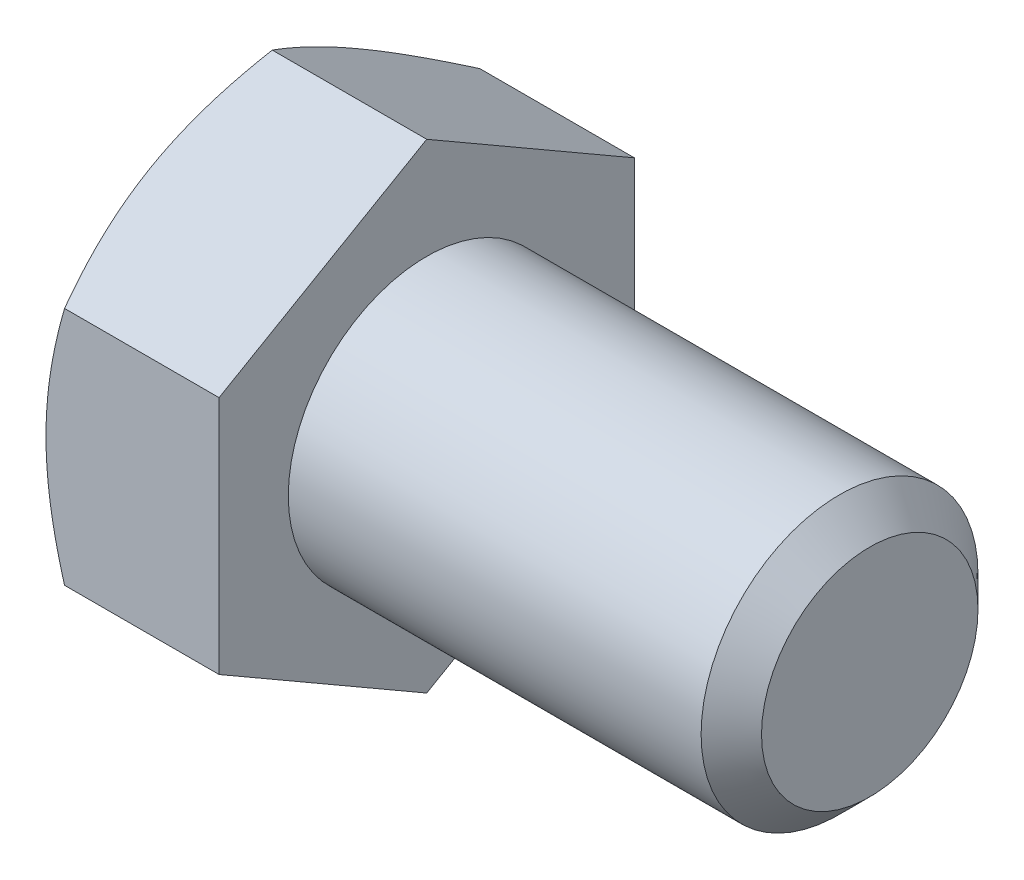
ISO-10303-21;
HEADER;
FILE_DESCRIPTION(('STEP AP214'),'2;1');
FILE_NAME('part.step','',(''),(''),'','','');
FILE_SCHEMA(('AUTOMOTIVE_DESIGN { 1 0 10303 214 1 1 1 1 }'));
ENDSEC;
DATA;
#1=APPLICATION_CONTEXT('core data for automotive mechanical design processes');
#2=APPLICATION_PROTOCOL_DEFINITION('international standard','automotive_design',2000,#1);
#3=PRODUCT_CONTEXT('',#1,'mechanical');
#4=PRODUCT('Part','Part','',(#3));
#5=PRODUCT_RELATED_PRODUCT_CATEGORY('part','',(#4));
#6=PRODUCT_DEFINITION_FORMATION('','',#4);
#7=PRODUCT_DEFINITION_CONTEXT('part definition',#1,'design');
#8=PRODUCT_DEFINITION('design','',#6,#7);
#9=PRODUCT_DEFINITION_SHAPE('','',#8);
#10=(LENGTH_UNIT() NAMED_UNIT(*) SI_UNIT(.MILLI.,.METRE.));
#11=(NAMED_UNIT(*) PLANE_ANGLE_UNIT() SI_UNIT($,.RADIAN.));
#12=(NAMED_UNIT(*) SI_UNIT($,.STERADIAN.) SOLID_ANGLE_UNIT());
#13=UNCERTAINTY_MEASURE_WITH_UNIT(LENGTH_MEASURE(1.E-05),#10,'distance_accuracy_value','');
#14=(GEOMETRIC_REPRESENTATION_CONTEXT(3) GLOBAL_UNCERTAINTY_ASSIGNED_CONTEXT((#13)) GLOBAL_UNIT_ASSIGNED_CONTEXT((#10,
#11,#12)) REPRESENTATION_CONTEXT('',''));
#15=CARTESIAN_POINT('',(0.,0.,0.));
#16=DIRECTION('',(0.,0.,1.));
#17=DIRECTION('',(1.,0.,0.));
#18=AXIS2_PLACEMENT_3D('',#15,#16,#17);
#19=CARTESIAN_POINT('',(-17.6609375,-6.87407664253899,11.90625));
#20=DIRECTION('',(0.,0.,-1.));
#21=DIRECTION('',(-1.,0.,0.));
#22=AXIS2_PLACEMENT_3D('',#19,#20,#21);
#23=PLANE('',#22);
#24=CARTESIAN_POINT('',(-11.6983109266214,-18.7772218205503,11.90625));
#25=CARTESIAN_POINT('',(-11.8257583832551,-18.5158354897771,11.90625));
#26=CARTESIAN_POINT('',(-11.9525934779157,-18.2541507199369,11.90625));
#27=CARTESIAN_POINT('',(-12.2049008250829,-17.7301221221741,11.90625));
#28=CARTESIAN_POINT('',(-12.3303730647936,-17.467778288092,11.90625));
#29=CARTESIAN_POINT('',(-12.7045694499173,-16.6795991897897,11.90625));
#30=CARTESIAN_POINT('',(-12.9510377236248,-16.1526890226135,11.90625));
#31=CARTESIAN_POINT('',(-13.4377865658701,-15.0927248953816,11.90625));
#32=CARTESIAN_POINT('',(-13.6780287586066,-14.5596532720591,11.90625));
#33=CARTESIAN_POINT('',(-14.1490923927283,-13.4893779810417,11.90625));
#34=CARTESIAN_POINT('',(-14.3799142595246,-12.9521745012417,11.90625));
#35=CARTESIAN_POINT('',(-14.8373074478187,-11.8544133465978,11.90625));
#36=CARTESIAN_POINT('',(-15.0634666996025,-11.2936831131682,11.90625));
#37=CARTESIAN_POINT('',(-15.4994141642614,-10.1657754256603,11.90625));
#38=CARTESIAN_POINT('',(-15.7092005847877,-9.59859727348685,11.90625));
#39=CARTESIAN_POINT('',(-16.1071202172178,-8.4578727593714,11.90625));
#40=CARTESIAN_POINT('',(-16.2952946616349,-7.88434089249067,11.90625));
#41=CARTESIAN_POINT('',(-16.6441726177729,-6.72900365882738,11.90625));
#42=CARTESIAN_POINT('',(-16.8048844557365,-6.14720085781889,11.90625));
#43=CARTESIAN_POINT('',(-17.0192630164799,-5.26975884963066,11.90625));
#44=CARTESIAN_POINT('',(-17.0861220054402,-4.97732530698046,11.90625));
#45=CARTESIAN_POINT('',(-17.2101737537244,-4.39040451361311,11.90625));
#46=CARTESIAN_POINT('',(-17.267366696036,-4.09591730188382,11.90625));
#47=CARTESIAN_POINT('',(-17.3710969326411,-3.50507073805768,11.90625));
#48=CARTESIAN_POINT('',(-17.4176345106605,-3.20871143602591,11.90625));
#49=CARTESIAN_POINT('',(-17.4991389343129,-2.6144072694984,11.90625));
#50=CARTESIAN_POINT('',(-17.5341062538852,-2.31646247045567,11.90625));
#51=CARTESIAN_POINT('',(-17.5913188666794,-1.72343014702121,11.90625));
#52=CARTESIAN_POINT('',(-17.613730479768,-1.42835876821268,11.90625));
#53=CARTESIAN_POINT('',(-17.6460429444085,-0.837532164616394,11.90625));
#54=CARTESIAN_POINT('',(-17.6559440126664,-0.541776951762824,11.90625));
#55=CARTESIAN_POINT('',(-17.66299814625,0.0498900771026859,11.90625));
#56=CARTESIAN_POINT('',(-17.6601511405493,0.345801893977965,11.90625));
#57=CARTESIAN_POINT('',(-17.6417819063079,0.937234824328524,11.90625));
#58=CARTESIAN_POINT('',(-17.62625911627,1.23275591991524,11.90625));
#59=CARTESIAN_POINT('',(-17.5747499938461,1.93361141110705,11.90625));
#60=CARTESIAN_POINT('',(-17.5332714162141,2.33855153268826,11.90625));
#61=CARTESIAN_POINT('',(-17.428707328606,3.14561014398731,11.90625));
#62=CARTESIAN_POINT('',(-17.3656191456599,3.54772827836109,11.90625));
#63=CARTESIAN_POINT('',(-17.1472706380464,4.74927526762175,11.90625));
#64=CARTESIAN_POINT('',(-16.9629591081591,5.54350507595654,11.90625));
#65=CARTESIAN_POINT('',(-16.6409428101219,6.73176932461939,11.90625));
#66=CARTESIAN_POINT('',(-16.5244083585998,7.13189689477012,11.90625));
#67=CARTESIAN_POINT('',(-16.2786408125562,7.92827150501895,11.90625));
#68=CARTESIAN_POINT('',(-16.1494076191541,8.32451851487406,11.90625));
#69=CARTESIAN_POINT('',(-15.8803651397193,9.11324994675125,11.90625));
#70=CARTESIAN_POINT('',(-15.7405587808335,9.50573537649753,11.90625));
#71=CARTESIAN_POINT('',(-15.452074221942,10.2874106596633,11.90625));
#72=CARTESIAN_POINT('',(-15.3033962317092,10.6766005907578,11.90625));
#73=CARTESIAN_POINT('',(-14.8889342485984,11.7312027633438,11.90625));
#74=CARTESIAN_POINT('',(-14.615900351469,12.3937631906751,11.90625));
#75=CARTESIAN_POINT('',(-14.0535954119244,13.7119837854872,11.90625));
#76=CARTESIAN_POINT('',(-13.7643225072077,14.3676431512684,11.90625));
#77=CARTESIAN_POINT('',(-13.1734132974516,15.6736609985504,11.90625));
#78=CARTESIAN_POINT('',(-12.8717721370412,16.3240172757676,11.90625));
#79=CARTESIAN_POINT('',(-12.2591092932324,17.620247338022,11.90625));
#80=CARTESIAN_POINT('',(-11.948088006186,18.2661213110418,11.90625));
#81=CARTESIAN_POINT('',(-11.3182048158751,19.5553426390711,11.90625));
#82=CARTESIAN_POINT('',(-10.9993308622046,20.1986840939835,11.90625));
#83=CARTESIAN_POINT('',(-10.3557656991429,21.4824527079599,11.90625));
#84=CARTESIAN_POINT('',(-10.0310744394496,22.1228798417637,11.90625));
#85=CARTESIAN_POINT('',(-9.37709843477089,23.4011999735386,11.90625));
#86=CARTESIAN_POINT('',(-9.04781473862017,24.0390935087297,11.90625));
#87=CARTESIAN_POINT('',(-8.38544954318028,25.3129009144794,11.90625));
#88=CARTESIAN_POINT('',(-8.05236805659013,25.9488147916486,11.90625));
#89=CARTESIAN_POINT('',(-7.12015249604064,27.7180307819919,11.90625));
#90=CARTESIAN_POINT('',(-6.51761405583556,28.8495387236042,11.90625));
#91=CARTESIAN_POINT('',(-5.30533612668338,31.1087745049665,11.90625));
#92=CARTESIAN_POINT('',(-4.69559618068544,32.236502098898,11.90625));
#93=CARTESIAN_POINT('',(-3.47284694487996,34.4851874135602,11.90625));
#94=CARTESIAN_POINT('',(-2.85985596551435,35.6061550972182,11.90625));
#95=CARTESIAN_POINT('',(-1.93733123744413,37.2858774098767,11.90625));
#96=CARTESIAN_POINT('',(-1.62932900566449,37.8454742841365,11.90625));
#97=CARTESIAN_POINT('',(-1.01241722629891,38.9641668226993,11.90625));
#98=CARTESIAN_POINT('',(-0.703507679836878,39.5232624876221,11.90625));
#99=CARTESIAN_POINT('',(-0.394200833252019,40.0821383241844,11.90625));
#100=B_SPLINE_CURVE_WITH_KNOTS('',3,(#24,#25,#26,#27,#28,#29,#30,#31,#32,#33,#34,#35,#36,#37,
#38,#39,#40,#41,#42,#43,#44,#45,#46,#47,#48,#49,#50,#51,#52,#53,#54,#55,#56,#57,#58,#59,#60,#61,
#62,#63,#64,#65,#66,#67,#68,#69,#70,#71,#72,#73,#74,#75,#76,#77,#78,#79,#80,#81,#82,#83,#84,#85,
#86,#87,#88,#89,#90,#91,#92,#93,#94,#95,#96,#97,#98,#99),.UNSPECIFIED.,.F.,.F.,(4,2,2,2,2,2,2,2,
2,2,2,2,2,2,2,2,2,2,2,2,2,2,2,2,2,2,2,2,2,2,2,2,2,2,2,2,2,4),(0.,0.872403820379927,
1.74481582466604,3.48988256497024,5.24393083208546,6.99789980054986,8.81156709625109,
10.6254326580858,12.4357780289765,14.2455735532143,15.1453771860194,16.0451637827662,
16.9449264176478,17.8446521920104,18.7321594384487,19.619651311404,20.507148129058,
21.3946842621433,22.6151782011098,23.8358231619315,26.2782867397697,27.5284299401181,
28.7785828756662,30.0283909685039,31.2781695208875,33.4276822788816,35.5774420502025,
37.7280539815674,39.8785751669937,42.0326321377131,44.1867077434857,46.3402991990204,
48.4938834554972,52.3396542760515,56.1856704980939,60.0185346247368,61.9348133105576,
63.8510896236465),.UNSPECIFIED.);
#101=CARTESIAN_POINT('',(-16.597514142539,-6.87407664253899,11.90625));
#102=VERTEX_POINT('',#101);
#103=CARTESIAN_POINT('',(-17.6609375,0.,11.90625));
#104=VERTEX_POINT('',#103);
#105=EDGE_CURVE('E252',#102,#104,#100,.T.);
#106=ORIENTED_EDGE('',*,*,#105,.F.);
#107=DIRECTION('',(1.,0.,0.));
#108=VECTOR('',#107,1.);
#109=CARTESIAN_POINT('',(-17.6609375,-6.87407664253899,11.90625));
#110=LINE('',#109,#108);
#111=CARTESIAN_POINT('',(-7.7390625,-6.87407664253899,11.90625));
#112=VERTEX_POINT('',#111);
#113=EDGE_CURVE('E255',#102,#112,#110,.T.);
#114=ORIENTED_EDGE('',*,*,#113,.T.);
#115=DIRECTION('',(0.,1.,0.));
#116=VECTOR('',#115,1.);
#117=CARTESIAN_POINT('',(-7.7390625,-6.87407664253899,11.90625));
#118=LINE('',#117,#116);
#119=CARTESIAN_POINT('',(-7.7390625,6.87407664253898,11.90625));
#120=VERTEX_POINT('',#119);
#121=EDGE_CURVE('E257',#112,#120,#118,.T.);
#122=ORIENTED_EDGE('',*,*,#121,.T.);
#123=DIRECTION('',(1.,0.,0.));
#124=VECTOR('',#123,1.);
#125=CARTESIAN_POINT('',(-17.6609375,6.87407664253898,11.90625));
#126=LINE('',#125,#124);
#127=CARTESIAN_POINT('',(-16.597514142539,6.87407664253898,11.90625));
#128=VERTEX_POINT('',#127);
#129=EDGE_CURVE('E225',#128,#120,#126,.T.);
#130=ORIENTED_EDGE('',*,*,#129,.F.);
#131=EDGE_CURVE('E109',#104,#128,#100,.T.);
#132=ORIENTED_EDGE('',*,*,#131,.F.);
#133=EDGE_LOOP('',(#106,#114,#122,#130,#132));
#134=FACE_BOUND('',#133,.T.);
#135=ADVANCED_FACE('F33',(#134),#23,.F.);
#136=CARTESIAN_POINT('',(-17.6609375,6.87407664253898,11.90625));
#137=DIRECTION('',(0.,-0.866025403784439,-0.5));
#138=DIRECTION('',(0.,0.5,-0.866025403784439));
#139=AXIS2_PLACEMENT_3D('',#136,#137,#138);
#140=PLANE('',#139);
#141=CARTESIAN_POINT('',(-16.5974474750324,6.87396117248515,11.90645));
#142=CARTESIAN_POINT('',(-16.6846744750194,7.02506816122369,11.6447250181261));
#143=CARTESIAN_POINT('',(-16.7679424783244,7.17673855441783,11.3820241911099));
#144=CARTESIAN_POINT('',(-16.9254619913358,7.48129562225099,10.8545158758187));
#145=CARTESIAN_POINT('',(-16.9997105355375,7.63418267940671,10.5897077250053));
#146=CARTESIAN_POINT('',(-17.2074900712694,8.09530730681964,9.79101644170481));
#147=CARTESIAN_POINT('',(-17.3256738427919,8.40536522454016,9.25398037492386));
#148=CARTESIAN_POINT('',(-17.4642549024794,8.86935268063619,8.45033052689091));
#149=CARTESIAN_POINT('',(-17.503731352266,9.02189605152492,8.18611765815379));
#150=CARTESIAN_POINT('',(-17.5699305741685,9.32768907969039,7.65646859677086));
#151=CARTESIAN_POINT('',(-17.5966531008064,9.48093875050415,7.39103238067823));
#152=CARTESIAN_POINT('',(-17.6366599934814,9.78769358825674,6.8597174162232));
#153=CARTESIAN_POINT('',(-17.6499603284218,9.94119823342702,6.59383957159043));
#154=CARTESIAN_POINT('',(-17.6628394218778,10.2483497596434,6.06183752256126));
#155=CARTESIAN_POINT('',(-17.6624186043582,10.4019966361481,5.79571332603086));
#156=CARTESIAN_POINT('',(-17.6488129978422,10.6892397431486,5.29819367058215));
#157=CARTESIAN_POINT('',(-17.6372877940381,10.8228564588259,5.06676273028853));
#158=CARTESIAN_POINT('',(-17.6040772768541,11.0897825729227,4.60443313880589));
#159=CARTESIAN_POINT('',(-17.5823912447956,11.2230919489337,4.3735345264297));
#160=CARTESIAN_POINT('',(-17.5292371488488,11.4893309362533,3.91239507343644));
#161=CARTESIAN_POINT('',(-17.4977610054902,11.6222601420414,3.68215493520155));
#162=CARTESIAN_POINT('',(-17.4255789533585,11.8874953505612,3.22275407808912));
#163=CARTESIAN_POINT('',(-17.3848724172385,12.0198013103096,2.99359343366088));
#164=CARTESIAN_POINT('',(-17.2478781970561,12.4214234794469,2.29796343126896));
#165=CARTESIAN_POINT('',(-17.1379306207102,12.6895766414943,1.83350853039266));
#166=CARTESIAN_POINT('',(-16.8883944268695,13.2218844172803,0.911524417467356));
#167=CARTESIAN_POINT('',(-16.7488644158584,13.4860458466265,0.453983400439706));
#168=CARTESIAN_POINT('',(-16.5974474750324,13.7482687551318,-0.000200000000001217));
#169=B_SPLINE_CURVE_WITH_KNOTS('',3,(#141,#142,#143,#144,#145,#146,#147,#148,#149,#150,#151,
#152,#153,#154,#155,#156,#157,#158,#159,#160,#161,#162,#163,#164,#165,#166,#167,#168),
.UNSPECIFIED.,.F.,.F.,(4,2,2,2,2,2,2,2,2,2,2,2,2,4),(0.,0.943575208414199,1.88745981967605,
3.77924706309544,4.70192280857966,5.62461631233488,6.54621075295352,7.4677767175883,
8.27002897862037,9.07233799178402,9.87531089002933,10.6783383789729,12.3197076467667,
13.9578550457927),.UNSPECIFIED.);
#170=CARTESIAN_POINT('',(-17.6609375,10.3111149638085,5.953125));
#171=VERTEX_POINT('',#170);
#172=EDGE_CURVE('E105',#128,#171,#169,.T.);
#173=ORIENTED_EDGE('',*,*,#172,.F.);
#174=ORIENTED_EDGE('',*,*,#129,.T.);
#175=DIRECTION('',(0.,0.5,-0.866025403784439));
#176=VECTOR('',#175,1.);
#177=CARTESIAN_POINT('',(-7.7390625,6.87407664253898,11.90625));
#178=LINE('',#177,#176);
#179=CARTESIAN_POINT('',(-7.7390625,13.748153285078,0.));
#180=VERTEX_POINT('',#179);
#181=EDGE_CURVE('E275',#120,#180,#178,.T.);
#182=ORIENTED_EDGE('',*,*,#181,.T.);
#183=DIRECTION('',(1.,0.,0.));
#184=VECTOR('',#183,1.);
#185=CARTESIAN_POINT('',(-17.6609375,13.748153285078,0.));
#186=LINE('',#185,#184);
#187=CARTESIAN_POINT('',(-16.597514142539,13.748153285078,0.));
#188=VERTEX_POINT('',#187);
#189=EDGE_CURVE('E128',#188,#180,#186,.T.);
#190=ORIENTED_EDGE('',*,*,#189,.F.);
#191=EDGE_CURVE('E113',#171,#188,#169,.T.);
#192=ORIENTED_EDGE('',*,*,#191,.F.);
#193=EDGE_LOOP('',(#173,#174,#182,#190,#192));
#194=FACE_BOUND('',#193,.T.);
#195=ADVANCED_FACE('F126',(#194),#140,.F.);
#196=CARTESIAN_POINT('',(-17.6609375,13.748153285078,0.));
#197=DIRECTION('',(0.,-0.866025403784439,0.5));
#198=DIRECTION('',(0.,-0.5,-0.866025403784439));
#199=AXIS2_PLACEMENT_3D('',#196,#197,#198);
#200=PLANE('',#199);
#201=CARTESIAN_POINT('',(-16.5974474750324,13.7482687551318,0.0001999999999974));
#202=CARTESIAN_POINT('',(-16.6846744750194,13.5971617663933,-0.261524981873897));
#203=CARTESIAN_POINT('',(-16.7679424783244,13.4454913731991,-0.524225808890103));
#204=CARTESIAN_POINT('',(-16.9254619913358,13.140934305366,-1.05173412418134));
#205=CARTESIAN_POINT('',(-16.9997105355375,12.9880472482102,-1.31654227499472));
#206=CARTESIAN_POINT('',(-17.2074900712694,12.5269226207973,-2.11523355829519));
#207=CARTESIAN_POINT('',(-17.3256738427919,12.2168647030768,-2.65226962507615));
#208=CARTESIAN_POINT('',(-17.4642549024794,11.7528772469808,-3.4559194731091));
#209=CARTESIAN_POINT('',(-17.503731352266,11.600333876092,-3.72013234184621));
#210=CARTESIAN_POINT('',(-17.5699305741685,11.2945408479266,-4.24978140322914));
#211=CARTESIAN_POINT('',(-17.5966531008064,11.1412911771128,-4.51521761932178));
#212=CARTESIAN_POINT('',(-17.6366599934814,10.8345363393602,-5.0465325837768));
#213=CARTESIAN_POINT('',(-17.6499603284218,10.6810316941899,-5.31241042840957));
#214=CARTESIAN_POINT('',(-17.6628394218778,10.3738801679735,-5.84441247743875));
#215=CARTESIAN_POINT('',(-17.6624186043582,10.2202332914688,-6.11053667396914));
#216=CARTESIAN_POINT('',(-17.6488129978422,9.93299018446836,-6.60805632941785));
#217=CARTESIAN_POINT('',(-17.6372877940381,9.79937346879103,-6.83948726971148));
#218=CARTESIAN_POINT('',(-17.6040772768541,9.5324473546942,-7.30181686119411));
#219=CARTESIAN_POINT('',(-17.5823912447956,9.39913797868329,-7.5327154735703));
#220=CARTESIAN_POINT('',(-17.5292371488488,9.13289899136368,-7.99385492656357));
#221=CARTESIAN_POINT('',(-17.4977610054902,8.99996978557551,-8.22409506479845));
#222=CARTESIAN_POINT('',(-17.4255789533585,8.7347345770557,-8.68349592191088));
#223=CARTESIAN_POINT('',(-17.3848724172385,8.60242861730739,-8.91265656633912));
#224=CARTESIAN_POINT('',(-17.2478781970561,8.20080644817004,-9.60828656873104));
#225=CARTESIAN_POINT('',(-17.1379306207102,7.93265328612267,-10.0727414696073));
#226=CARTESIAN_POINT('',(-16.8883944268694,7.40034551033668,-10.9947255825326));
#227=CARTESIAN_POINT('',(-16.7488644158584,7.13618408099047,-11.4522665995603));
#228=CARTESIAN_POINT('',(-16.5974474750324,6.87396117248515,-11.90645));
#229=B_SPLINE_CURVE_WITH_KNOTS('',3,(#201,#202,#203,#204,#205,#206,#207,#208,#209,#210,#211,
#212,#213,#214,#215,#216,#217,#218,#219,#220,#221,#222,#223,#224,#225,#226,#227,#228),
.UNSPECIFIED.,.F.,.F.,(4,2,2,2,2,2,2,2,2,2,2,2,2,4),(0.,0.943575208414197,1.88745981967605,
3.77924706309544,4.70192280857966,5.62461631233488,6.54621075295352,7.4677767175883,
8.27002897862037,9.07233799178402,9.87531089002933,10.6783383789729,12.3197076467667,
13.9578550457927),.UNSPECIFIED.);
#230=CARTESIAN_POINT('',(-17.6609375,10.3111149638085,-5.953125));
#231=VERTEX_POINT('',#230);
#232=EDGE_CURVE('E118',#188,#231,#229,.T.);
#233=ORIENTED_EDGE('',*,*,#232,.F.);
#234=ORIENTED_EDGE('',*,*,#189,.T.);
#235=DIRECTION('',(0.,-0.5,-0.866025403784439));
#236=VECTOR('',#235,1.);
#237=CARTESIAN_POINT('',(-7.7390625,13.748153285078,0.));
#238=LINE('',#237,#236);
#239=CARTESIAN_POINT('',(-7.7390625,6.87407664253898,-11.90625));
#240=VERTEX_POINT('',#239);
#241=EDGE_CURVE('E272',#180,#240,#238,.T.);
#242=ORIENTED_EDGE('',*,*,#241,.T.);
#243=DIRECTION('',(1.,0.,0.));
#244=VECTOR('',#243,1.);
#245=CARTESIAN_POINT('',(-17.6609375,6.87407664253898,-11.90625));
#246=LINE('',#245,#244);
#247=CARTESIAN_POINT('',(-16.597514142539,6.87407664253898,-11.90625));
#248=VERTEX_POINT('',#247);
#249=EDGE_CURVE('E269',#248,#240,#246,.T.);
#250=ORIENTED_EDGE('',*,*,#249,.F.);
#251=EDGE_CURVE('E129',#231,#248,#229,.T.);
#252=ORIENTED_EDGE('',*,*,#251,.F.);
#253=EDGE_LOOP('',(#233,#234,#242,#250,#252));
#254=FACE_BOUND('',#253,.T.);
#255=ADVANCED_FACE('F189',(#254),#200,.F.);
#256=CARTESIAN_POINT('',(-17.6609375,6.87407664253898,-11.90625));
#257=DIRECTION('',(0.,0.,1.));
#258=DIRECTION('',(1.,0.,0.));
#259=AXIS2_PLACEMENT_3D('',#256,#257,#258);
#260=PLANE('',#259);
#261=CARTESIAN_POINT('',(-11.6983109266214,-18.7772218205503,-11.90625));
#262=CARTESIAN_POINT('',(-11.8257583832551,-18.5158354897771,-11.90625));
#263=CARTESIAN_POINT('',(-11.9525934779157,-18.2541507199369,-11.90625));
#264=CARTESIAN_POINT('',(-12.2049008250829,-17.7301221221741,-11.90625));
#265=CARTESIAN_POINT('',(-12.3303730647936,-17.467778288092,-11.90625));
#266=CARTESIAN_POINT('',(-12.7045694499173,-16.6795991897897,-11.90625));
#267=CARTESIAN_POINT('',(-12.9510377236248,-16.1526890226135,-11.90625));
#268=CARTESIAN_POINT('',(-13.4377865658701,-15.0927248953816,-11.90625));
#269=CARTESIAN_POINT('',(-13.6780287586066,-14.5596532720591,-11.90625));
#270=CARTESIAN_POINT('',(-14.1490923927283,-13.4893779810417,-11.90625));
#271=CARTESIAN_POINT('',(-14.3799142595246,-12.9521745012417,-11.90625));
#272=CARTESIAN_POINT('',(-14.8373074478187,-11.8544133465978,-11.90625));
#273=CARTESIAN_POINT('',(-15.0634666996025,-11.2936831131682,-11.90625));
#274=CARTESIAN_POINT('',(-15.4994141642614,-10.1657754256603,-11.90625));
#275=CARTESIAN_POINT('',(-15.7092005847877,-9.59859727348685,-11.90625));
#276=CARTESIAN_POINT('',(-16.1071202172178,-8.45787275937139,-11.90625));
#277=CARTESIAN_POINT('',(-16.2952946616349,-7.88434089249066,-11.90625));
#278=CARTESIAN_POINT('',(-16.6441726177729,-6.72900365882737,-11.90625));
#279=CARTESIAN_POINT('',(-16.8048844557365,-6.14720085781889,-11.90625));
#280=CARTESIAN_POINT('',(-17.0192630164799,-5.26975884963066,-11.90625));
#281=CARTESIAN_POINT('',(-17.0861220054402,-4.97732530698045,-11.90625));
#282=CARTESIAN_POINT('',(-17.2101737537244,-4.39040451361311,-11.90625));
#283=CARTESIAN_POINT('',(-17.267366696036,-4.09591730188382,-11.90625));
#284=CARTESIAN_POINT('',(-17.3710969326411,-3.50507073805768,-11.90625));
#285=CARTESIAN_POINT('',(-17.4176345106605,-3.20871143602591,-11.90625));
#286=CARTESIAN_POINT('',(-17.4991389343129,-2.6144072694984,-11.90625));
#287=CARTESIAN_POINT('',(-17.5341062538852,-2.31646247045566,-11.90625));
#288=CARTESIAN_POINT('',(-17.5913188666794,-1.72343014702121,-11.90625));
#289=CARTESIAN_POINT('',(-17.613730479768,-1.42835876821267,-11.90625));
#290=CARTESIAN_POINT('',(-17.6460429444085,-0.83753216461639,-11.90625));
#291=CARTESIAN_POINT('',(-17.6559440126664,-0.541776951762821,-11.90625));
#292=CARTESIAN_POINT('',(-17.66299814625,0.0498900771026877,-11.90625));
#293=CARTESIAN_POINT('',(-17.6601511405493,0.345801893977967,-11.90625));
#294=CARTESIAN_POINT('',(-17.6417819063079,0.937234824328527,-11.90625));
#295=CARTESIAN_POINT('',(-17.62625911627,1.23275591991524,-11.90625));
#296=CARTESIAN_POINT('',(-17.5747499938461,1.93361141110705,-11.90625));
#297=CARTESIAN_POINT('',(-17.5332714162141,2.33855153268826,-11.90625));
#298=CARTESIAN_POINT('',(-17.428707328606,3.14561014398732,-11.90625));
#299=CARTESIAN_POINT('',(-17.3656191456599,3.5477282783611,-11.90625));
#300=CARTESIAN_POINT('',(-17.1472706380464,4.74927526762176,-11.90625));
#301=CARTESIAN_POINT('',(-16.9629591081591,5.54350507595655,-11.90625));
#302=CARTESIAN_POINT('',(-16.6409428101219,6.7317693246194,-11.90625));
#303=CARTESIAN_POINT('',(-16.5244083585998,7.13189689477013,-11.90625));
#304=CARTESIAN_POINT('',(-16.2786408125562,7.92827150501896,-11.90625));
#305=CARTESIAN_POINT('',(-16.1494076191541,8.32451851487406,-11.90625));
#306=CARTESIAN_POINT('',(-15.8803651397193,9.11324994675126,-11.90625));
#307=CARTESIAN_POINT('',(-15.7405587808335,9.50573537649753,-11.90625));
#308=CARTESIAN_POINT('',(-15.452074221942,10.2874106596633,-11.90625));
#309=CARTESIAN_POINT('',(-15.3033962317091,10.6766005907578,-11.90625));
#310=CARTESIAN_POINT('',(-14.8889342485984,11.7312027633439,-11.90625));
#311=CARTESIAN_POINT('',(-14.615900351469,12.3937631906751,-11.90625));
#312=CARTESIAN_POINT('',(-14.0535954119244,13.7119837854872,-11.90625));
#313=CARTESIAN_POINT('',(-13.7643225072077,14.3676431512685,-11.90625));
#314=CARTESIAN_POINT('',(-13.1734132974516,15.6736609985504,-11.90625));
#315=CARTESIAN_POINT('',(-12.8717721370412,16.3240172757676,-11.90625));
#316=CARTESIAN_POINT('',(-12.2591092932324,17.620247338022,-11.90625));
#317=CARTESIAN_POINT('',(-11.948088006186,18.2661213110418,-11.90625));
#318=CARTESIAN_POINT('',(-11.3182048158751,19.5553426390711,-11.90625));
#319=CARTESIAN_POINT('',(-10.9993308622046,20.1986840939835,-11.90625));
#320=CARTESIAN_POINT('',(-10.3557656991428,21.4824527079599,-11.90625));
#321=CARTESIAN_POINT('',(-10.0310744394495,22.1228798417637,-11.90625));
#322=CARTESIAN_POINT('',(-9.37709843477088,23.4011999735386,-11.90625));
#323=CARTESIAN_POINT('',(-9.04781473862016,24.0390935087297,-11.90625));
#324=CARTESIAN_POINT('',(-8.38544954318027,25.3129009144795,-11.90625));
#325=CARTESIAN_POINT('',(-8.05236805659012,25.9488147916486,-11.90625));
#326=CARTESIAN_POINT('',(-7.12015249604063,27.7180307819919,-11.90625));
#327=CARTESIAN_POINT('',(-6.51761405583555,28.8495387236043,-11.90625));
#328=CARTESIAN_POINT('',(-5.30533612668337,31.1087745049665,-11.90625));
#329=CARTESIAN_POINT('',(-4.69559618068544,32.236502098898,-11.90625));
#330=CARTESIAN_POINT('',(-3.47284694487996,34.4851874135602,-11.90625));
#331=CARTESIAN_POINT('',(-2.85985596551435,35.6061550972182,-11.90625));
#332=CARTESIAN_POINT('',(-1.93733123744412,37.2858774098767,-11.90625));
#333=CARTESIAN_POINT('',(-1.62932900566449,37.8454742841365,-11.90625));
#334=CARTESIAN_POINT('',(-1.01241722629891,38.9641668226993,-11.90625));
#335=CARTESIAN_POINT('',(-0.703507679836873,39.5232624876221,-11.90625));
#336=CARTESIAN_POINT('',(-0.394200833252017,40.0821383241844,-11.90625));
#337=B_SPLINE_CURVE_WITH_KNOTS('',3,(#261,#262,#263,#264,#265,#266,#267,#268,#269,#270,#271,
#272,#273,#274,#275,#276,#277,#278,#279,#280,#281,#282,#283,#284,#285,#286,#287,#288,#289,#290,
#291,#292,#293,#294,#295,#296,#297,#298,#299,#300,#301,#302,#303,#304,#305,#306,#307,#308,#309,
#310,#311,#312,#313,#314,#315,#316,#317,#318,#319,#320,#321,#322,#323,#324,#325,#326,#327,#328,
#329,#330,#331,#332,#333,#334,#335,#336),.UNSPECIFIED.,.F.,.F.,(4,2,2,2,2,2,2,2,2,2,2,2,2,2,2,2,
2,2,2,2,2,2,2,2,2,2,2,2,2,2,2,2,2,2,2,2,2,4),(0.,0.87240382037993,1.74481582466605,
3.48988256497024,5.24393083208547,6.99789980054987,8.8115670962511,10.6254326580858,
12.4357780289765,14.2455735532143,15.1453771860194,16.0451637827662,16.9449264176478,
17.8446521920104,18.7321594384487,19.6196513114039,20.507148129058,21.3946842621433,
22.6151782011098,23.8358231619315,26.2782867397697,27.5284299401181,28.7785828756662,
30.0283909685039,31.2781695208875,33.4276822788816,35.5774420502025,37.7280539815674,
39.8785751669937,42.0326321377131,44.1867077434858,46.3402991990204,48.4938834554972,
52.3396542760515,56.1856704980938,60.0185346247368,61.9348133105577,63.8510896236465),.UNSPECIFIED.);
#338=CARTESIAN_POINT('',(-17.6609375,0.,-11.90625));
#339=VERTEX_POINT('',#338);
#340=EDGE_CURVE('E183',#248,#339,#337,.F.);
#341=ORIENTED_EDGE('',*,*,#340,.F.);
#342=ORIENTED_EDGE('',*,*,#249,.T.);
#343=DIRECTION('',(0.,-1.,0.));
#344=VECTOR('',#343,1.);
#345=CARTESIAN_POINT('',(-7.7390625,6.87407664253898,-11.90625));
#346=LINE('',#345,#344);
#347=CARTESIAN_POINT('',(-7.7390625,-6.87407664253899,-11.90625));
#348=VERTEX_POINT('',#347);
#349=EDGE_CURVE('E279',#240,#348,#346,.T.);
#350=ORIENTED_EDGE('',*,*,#349,.T.);
#351=DIRECTION('',(1.,0.,0.));
#352=VECTOR('',#351,1.);
#353=CARTESIAN_POINT('',(-17.6609375,-6.87407664253899,-11.90625));
#354=LINE('',#353,#352);
#355=CARTESIAN_POINT('',(-16.597514142539,-6.87407664253899,-11.90625));
#356=VERTEX_POINT('',#355);
#357=EDGE_CURVE('E240',#356,#348,#354,.T.);
#358=ORIENTED_EDGE('',*,*,#357,.F.);
#359=EDGE_CURVE('E177',#339,#356,#337,.F.);
#360=ORIENTED_EDGE('',*,*,#359,.F.);
#361=EDGE_LOOP('',(#341,#342,#350,#358,#360));
#362=FACE_BOUND('',#361,.T.);
#363=ADVANCED_FACE('F185',(#362),#260,.F.);
#364=CARTESIAN_POINT('',(-17.6609375,-6.87407664253899,-11.90625));
#365=DIRECTION('',(0.,0.866025403784439,0.5));
#366=DIRECTION('',(0.,-0.5,0.866025403784439));
#367=AXIS2_PLACEMENT_3D('',#364,#365,#366);
#368=PLANE('',#367);
#369=CARTESIAN_POINT('',(-16.5974474750324,-6.87396117248515,-11.90645));
#370=CARTESIAN_POINT('',(-16.6846744750194,-7.02506816122369,-11.6447250181261));
#371=CARTESIAN_POINT('',(-16.7679424783244,-7.17673855441783,-11.3820241911099));
#372=CARTESIAN_POINT('',(-16.9254619913358,-7.481295622251,-10.8545158758187));
#373=CARTESIAN_POINT('',(-16.9997105355375,-7.63418267940671,-10.5897077250053));
#374=CARTESIAN_POINT('',(-17.2074900712694,-8.09530730681964,-9.79101644170482));
#375=CARTESIAN_POINT('',(-17.3256738427919,-8.40536522454016,-9.25398037492386));
#376=CARTESIAN_POINT('',(-17.4642549024794,-8.86935268063619,-8.45033052689091));
#377=CARTESIAN_POINT('',(-17.503731352266,-9.02189605152493,-8.18611765815379));
#378=CARTESIAN_POINT('',(-17.5699305741685,-9.32768907969039,-7.65646859677086));
#379=CARTESIAN_POINT('',(-17.5966531008064,-9.48093875050415,-7.39103238067823));
#380=CARTESIAN_POINT('',(-17.6366599934814,-9.78769358825674,-6.8597174162232));
#381=CARTESIAN_POINT('',(-17.6499603284218,-9.94119823342703,-6.59383957159043));
#382=CARTESIAN_POINT('',(-17.6628394218778,-10.2483497596435,-6.06183752256126));
#383=CARTESIAN_POINT('',(-17.6624186043582,-10.4019966361481,-5.79571332603086));
#384=CARTESIAN_POINT('',(-17.6488129978422,-10.6892397431486,-5.29819367058216));
#385=CARTESIAN_POINT('',(-17.6372877940381,-10.8228564588259,-5.06676273028853));
#386=CARTESIAN_POINT('',(-17.6040772768541,-11.0897825729228,-4.60443313880589));
#387=CARTESIAN_POINT('',(-17.5823912447956,-11.2230919489337,-4.3735345264297));
#388=CARTESIAN_POINT('',(-17.5292371488488,-11.4893309362533,-3.91239507343644));
#389=CARTESIAN_POINT('',(-17.4977610054902,-11.6222601420414,-3.68215493520155));
#390=CARTESIAN_POINT('',(-17.4255789533585,-11.8874953505613,-3.22275407808912));
#391=CARTESIAN_POINT('',(-17.3848724172385,-12.0198013103096,-2.99359343366088));
#392=CARTESIAN_POINT('',(-17.2478781970561,-12.4214234794469,-2.29796343126896));
#393=CARTESIAN_POINT('',(-17.1379306207102,-12.6895766414943,-1.83350853039267));
#394=CARTESIAN_POINT('',(-16.8883944268694,-13.2218844172803,-0.911524417467358));
#395=CARTESIAN_POINT('',(-16.7488644158584,-13.4860458466265,-0.45398340043971));
#396=CARTESIAN_POINT('',(-16.5974474750324,-13.7482687551318,0.000199999999998467));
#397=B_SPLINE_CURVE_WITH_KNOTS('',3,(#369,#370,#371,#372,#373,#374,#375,#376,#377,#378,#379,
#380,#381,#382,#383,#384,#385,#386,#387,#388,#389,#390,#391,#392,#393,#394,#395,#396),
.UNSPECIFIED.,.F.,.F.,(4,2,2,2,2,2,2,2,2,2,2,2,2,4),(0.,0.943575208414198,1.88745981967605,
3.77924706309544,4.70192280857966,5.62461631233488,6.54621075295353,7.46777671758831,
8.27002897862037,9.07233799178403,9.87531089002934,10.678338378973,12.3197076467667,
13.9578550457927),.UNSPECIFIED.);
#398=CARTESIAN_POINT('',(-17.6609375,-10.3111149638085,-5.953125));
#399=VERTEX_POINT('',#398);
#400=EDGE_CURVE('E184',#356,#399,#397,.T.);
#401=ORIENTED_EDGE('',*,*,#400,.F.);
#402=ORIENTED_EDGE('',*,*,#357,.T.);
#403=DIRECTION('',(0.,-0.5,0.866025403784439));
#404=VECTOR('',#403,1.);
#405=CARTESIAN_POINT('',(-7.7390625,-6.87407664253899,-11.90625));
#406=LINE('',#405,#404);
#407=CARTESIAN_POINT('',(-7.7390625,-13.748153285078,0.));
#408=VERTEX_POINT('',#407);
#409=EDGE_CURVE('E264',#348,#408,#406,.T.);
#410=ORIENTED_EDGE('',*,*,#409,.T.);
#411=DIRECTION('',(1.,0.,0.));
#412=VECTOR('',#411,1.);
#413=CARTESIAN_POINT('',(-17.6609375,-13.748153285078,0.));
#414=LINE('',#413,#412);
#415=CARTESIAN_POINT('',(-16.597514142539,-13.748153285078,0.));
#416=VERTEX_POINT('',#415);
#417=EDGE_CURVE('E261',#416,#408,#414,.T.);
#418=ORIENTED_EDGE('',*,*,#417,.F.);
#419=EDGE_CURVE('E171',#399,#416,#397,.T.);
#420=ORIENTED_EDGE('',*,*,#419,.F.);
#421=EDGE_LOOP('',(#401,#402,#410,#418,#420));
#422=FACE_BOUND('',#421,.T.);
#423=ADVANCED_FACE('F188',(#422),#368,.F.);
#424=CARTESIAN_POINT('',(-17.6609375,-13.748153285078,0.));
#425=DIRECTION('',(0.,0.866025403784439,-0.5));
#426=DIRECTION('',(0.,0.5,0.866025403784439));
#427=AXIS2_PLACEMENT_3D('',#424,#425,#426);
#428=PLANE('',#427);
#429=CARTESIAN_POINT('',(-16.5974474750324,-13.7482687551318,-0.000200000000002036));
#430=CARTESIAN_POINT('',(-16.6846744750194,-13.5971617663933,0.261524981873892));
#431=CARTESIAN_POINT('',(-16.7679424783244,-13.4454913731991,0.524225808890098));
#432=CARTESIAN_POINT('',(-16.9254619913358,-13.140934305366,1.05173412418134));
#433=CARTESIAN_POINT('',(-16.9997105355375,-12.9880472482102,1.31654227499472));
#434=CARTESIAN_POINT('',(-17.2074900712694,-12.5269226207973,2.11523355829519));
#435=CARTESIAN_POINT('',(-17.3256738427919,-12.2168647030768,2.65226962507614));
#436=CARTESIAN_POINT('',(-17.4642549024794,-11.7528772469808,3.45591947310909));
#437=CARTESIAN_POINT('',(-17.503731352266,-11.600333876092,3.72013234184621));
#438=CARTESIAN_POINT('',(-17.5699305741685,-11.2945408479266,4.24978140322914));
#439=CARTESIAN_POINT('',(-17.5966531008064,-11.1412911771128,4.51521761932178));
#440=CARTESIAN_POINT('',(-17.6366599934814,-10.8345363393602,5.0465325837768));
#441=CARTESIAN_POINT('',(-17.6499603284218,-10.6810316941899,5.31241042840957));
#442=CARTESIAN_POINT('',(-17.6628394218778,-10.3738801679735,5.84441247743874));
#443=CARTESIAN_POINT('',(-17.6624186043582,-10.2202332914688,6.11053667396914));
#444=CARTESIAN_POINT('',(-17.6488129978422,-9.93299018446836,6.60805632941785));
#445=CARTESIAN_POINT('',(-17.6372877940381,-9.79937346879103,6.83948726971147));
#446=CARTESIAN_POINT('',(-17.6040772768541,-9.5324473546942,7.30181686119411));
#447=CARTESIAN_POINT('',(-17.5823912447956,-9.3991379786833,7.5327154735703));
#448=CARTESIAN_POINT('',(-17.5292371488488,-9.13289899136368,7.99385492656356));
#449=CARTESIAN_POINT('',(-17.4977610054902,-8.99996978557551,8.22409506479845));
#450=CARTESIAN_POINT('',(-17.4255789533585,-8.73473457705571,8.68349592191088));
#451=CARTESIAN_POINT('',(-17.3848724172385,-8.60242861730739,8.91265656633912));
#452=CARTESIAN_POINT('',(-17.2478781970561,-8.20080644817004,9.60828656873104));
#453=CARTESIAN_POINT('',(-17.1379306207102,-7.93265328612267,10.0727414696073));
#454=CARTESIAN_POINT('',(-16.8883944268695,-7.40034551033668,10.9947255825326));
#455=CARTESIAN_POINT('',(-16.7488644158584,-7.13618408099047,11.4522665995603));
#456=CARTESIAN_POINT('',(-16.5974474750324,-6.87396117248515,11.90645));
#457=B_SPLINE_CURVE_WITH_KNOTS('',3,(#429,#430,#431,#432,#433,#434,#435,#436,#437,#438,#439,
#440,#441,#442,#443,#444,#445,#446,#447,#448,#449,#450,#451,#452,#453,#454,#455,#456),
.UNSPECIFIED.,.F.,.F.,(4,2,2,2,2,2,2,2,2,2,2,2,2,4),(0.,0.943575208414198,1.88745981967605,
3.77924706309544,4.70192280857966,5.62461631233488,6.54621075295352,7.46777671758831,
8.27002897862037,9.07233799178402,9.87531089002933,10.678338378973,12.3197076467667,
13.9578550457927),.UNSPECIFIED.);
#458=CARTESIAN_POINT('',(-17.6609375,-10.3111149638085,5.953125));
#459=VERTEX_POINT('',#458);
#460=EDGE_CURVE('E247',#416,#459,#457,.T.);
#461=ORIENTED_EDGE('',*,*,#460,.F.);
#462=ORIENTED_EDGE('',*,*,#417,.T.);
#463=DIRECTION('',(0.,0.5,0.866025403784439));
#464=VECTOR('',#463,1.);
#465=CARTESIAN_POINT('',(-7.7390625,-13.748153285078,0.));
#466=LINE('',#465,#464);
#467=EDGE_CURVE('E259',#408,#112,#466,.T.);
#468=ORIENTED_EDGE('',*,*,#467,.T.);
#469=ORIENTED_EDGE('',*,*,#113,.F.);
#470=EDGE_CURVE('E123',#459,#102,#457,.T.);
#471=ORIENTED_EDGE('',*,*,#470,.F.);
#472=EDGE_LOOP('',(#461,#462,#468,#469,#471));
#473=FACE_BOUND('',#472,.T.);
#474=ADVANCED_FACE('F210',(#473),#428,.F.);
#475=CARTESIAN_POINT('',(-7.7390625,0.,0.));
#476=DIRECTION('',(1.,0.,0.));
#477=DIRECTION('',(0.,0.,-1.));
#478=AXIS2_PLACEMENT_3D('',#475,#476,#477);
#479=CYLINDRICAL_SURFACE('',#478,7.9375);
#480=CARTESIAN_POINT('',(15.9291193181818,0.,0.));
#481=DIRECTION('',(1.,0.,0.));
#482=DIRECTION('',(0.,0.,-1.));
#483=AXIS2_PLACEMENT_3D('',#480,#481,#482);
#484=CIRCLE('',#483,7.9375);
#485=CARTESIAN_POINT('',(15.9291193181818,0.,-7.9375));
#486=VERTEX_POINT('',#485);
#487=EDGE_CURVE('E219',#486,#486,#484,.F.);
#488=ORIENTED_EDGE('',*,*,#487,.T.);
#489=EDGE_LOOP('',(#488));
#490=FACE_BOUND('',#489,.T.);
#491=CARTESIAN_POINT('',(-7.7390625,0.,0.));
#492=DIRECTION('',(-1.,0.,0.));
#493=DIRECTION('',(0.,0.,1.));
#494=AXIS2_PLACEMENT_3D('',#491,#492,#493);
#495=CIRCLE('',#494,7.9375);
#496=CARTESIAN_POINT('',(-7.7390625,0.,7.9375));
#497=VERTEX_POINT('',#496);
#498=EDGE_CURVE('E222',#497,#497,#495,.F.);
#499=ORIENTED_EDGE('',*,*,#498,.T.);
#500=EDGE_LOOP('',(#499));
#501=FACE_BOUND('',#500,.T.);
#502=ADVANCED_FACE('F207',(#490,#501),#479,.T.);
#503=CARTESIAN_POINT('',(17.6609375,0.,0.));
#504=DIRECTION('',(1.,0.,0.));
#505=DIRECTION('',(0.,0.,-1.));
#506=AXIS2_PLACEMENT_3D('',#503,#504,#505);
#507=PLANE('',#506);
#508=CARTESIAN_POINT('',(17.6609375,0.,0.));
#509=DIRECTION('',(1.,0.,0.));
#510=DIRECTION('',(0.,0.,-1.));
#511=AXIS2_PLACEMENT_3D('',#508,#509,#510);
#512=CIRCLE('',#511,6.20568181818182);
#513=CARTESIAN_POINT('',(17.6609375,0.,-6.20568181818182));
#514=VERTEX_POINT('',#513);
#515=EDGE_CURVE('E224',#514,#514,#512,.T.);
#516=ORIENTED_EDGE('',*,*,#515,.T.);
#517=EDGE_LOOP('',(#516));
#518=FACE_BOUND('',#517,.T.);
#519=ADVANCED_FACE('F205',(#518),#507,.T.);
#520=CARTESIAN_POINT('',(17.6609375,0.,0.));
#521=DIRECTION('',(-1.,0.,0.));
#522=DIRECTION('',(0.,0.,1.));
#523=AXIS2_PLACEMENT_3D('',#520,#521,#522);
#524=CONICAL_SURFACE('',#523,6.20568181818182,0.785398163397445);
#525=ORIENTED_EDGE('',*,*,#487,.F.);
#526=EDGE_LOOP('',(#525));
#527=FACE_BOUND('',#526,.T.);
#528=ORIENTED_EDGE('',*,*,#515,.F.);
#529=EDGE_LOOP('',(#528));
#530=FACE_BOUND('',#529,.T.);
#531=ADVANCED_FACE('F35',(#527,#530),#524,.T.);
#532=CARTESIAN_POINT('',(-7.7390625,6.87407664253898,11.90625));
#533=DIRECTION('',(-1.,0.,0.));
#534=DIRECTION('',(0.,0.,1.));
#535=AXIS2_PLACEMENT_3D('',#532,#533,#534);
#536=PLANE('',#535);
#537=ORIENTED_EDGE('',*,*,#498,.F.);
#538=EDGE_LOOP('',(#537));
#539=FACE_BOUND('',#538,.T.);
#540=ORIENTED_EDGE('',*,*,#121,.F.);
#541=ORIENTED_EDGE('',*,*,#467,.F.);
#542=ORIENTED_EDGE('',*,*,#409,.F.);
#543=ORIENTED_EDGE('',*,*,#349,.F.);
#544=ORIENTED_EDGE('',*,*,#241,.F.);
#545=ORIENTED_EDGE('',*,*,#181,.F.);
#546=EDGE_LOOP('',(#540,#541,#542,#543,#544,#545));
#547=FACE_BOUND('',#546,.T.);
#548=ADVANCED_FACE('F156',(#539,#547),#536,.F.);
#549=CARTESIAN_POINT('',(-17.6609375,0.,0.));
#550=DIRECTION('',(1.,0.,0.));
#551=DIRECTION('',(0.,0.,1.));
#552=AXIS2_PLACEMENT_3D('',#549,#550,#551);
#553=CONICAL_SURFACE('',#552,11.90625,1.0471975511966);
#554=ORIENTED_EDGE('',*,*,#105,.T.);
#555=CARTESIAN_POINT('',(-17.6609375,0.,0.));
#556=DIRECTION('',(-1.,0.,0.));
#557=DIRECTION('',(0.,0.,1.));
#558=AXIS2_PLACEMENT_3D('',#555,#556,#557);
#559=CIRCLE('',#558,11.90625);
#560=EDGE_CURVE('E37',#459,#104,#559,.T.);
#561=ORIENTED_EDGE('',*,*,#560,.F.);
#562=ORIENTED_EDGE('',*,*,#470,.T.);
#563=EDGE_LOOP('',(#554,#561,#562));
#564=FACE_BOUND('',#563,.T.);
#565=ADVANCED_FACE('F151',(#564),#553,.T.);
#566=ORIENTED_EDGE('',*,*,#419,.T.);
#567=ORIENTED_EDGE('',*,*,#460,.T.);
#568=EDGE_CURVE('E57',#399,#459,#559,.T.);
#569=ORIENTED_EDGE('',*,*,#568,.F.);
#570=EDGE_LOOP('',(#566,#567,#569));
#571=FACE_BOUND('',#570,.T.);
#572=ADVANCED_FACE('F155',(#571),#553,.T.);
#573=ORIENTED_EDGE('',*,*,#359,.T.);
#574=ORIENTED_EDGE('',*,*,#400,.T.);
#575=EDGE_CURVE('E231',#339,#399,#559,.T.);
#576=ORIENTED_EDGE('',*,*,#575,.F.);
#577=EDGE_LOOP('',(#573,#574,#576));
#578=FACE_BOUND('',#577,.T.);
#579=ADVANCED_FACE('F243',(#578),#553,.T.);
#580=ORIENTED_EDGE('',*,*,#251,.T.);
#581=ORIENTED_EDGE('',*,*,#340,.T.);
#582=EDGE_CURVE('E42',#231,#339,#559,.T.);
#583=ORIENTED_EDGE('',*,*,#582,.F.);
#584=EDGE_LOOP('',(#580,#581,#583));
#585=FACE_BOUND('',#584,.T.);
#586=ADVANCED_FACE('F282',(#585),#553,.T.);
#587=ORIENTED_EDGE('',*,*,#191,.T.);
#588=ORIENTED_EDGE('',*,*,#232,.T.);
#589=EDGE_CURVE('E12',#171,#231,#559,.T.);
#590=ORIENTED_EDGE('',*,*,#589,.F.);
#591=EDGE_LOOP('',(#587,#588,#590));
#592=FACE_BOUND('',#591,.T.);
#593=ADVANCED_FACE('F116',(#592),#553,.T.);
#594=ORIENTED_EDGE('',*,*,#131,.T.);
#595=ORIENTED_EDGE('',*,*,#172,.T.);
#596=CARTESIAN_POINT('',(-17.6609375,0.,0.));
#597=DIRECTION('',(-1.,0.,0.));
#598=DIRECTION('',(0.,0.,1.));
#599=AXIS2_PLACEMENT_3D('',#596,#597,#598);
#600=CIRCLE('',#599,11.90625);
#601=EDGE_CURVE('E49',#104,#171,#600,.T.);
#602=ORIENTED_EDGE('',*,*,#601,.F.);
#603=EDGE_LOOP('',(#594,#595,#602));
#604=FACE_BOUND('',#603,.T.);
#605=ADVANCED_FACE('F107',(#604),#553,.T.);
#606=CARTESIAN_POINT('',(-17.6609375,6.87407664253898,11.90625));
#607=DIRECTION('',(-1.,0.,0.));
#608=DIRECTION('',(0.,0.,1.));
#609=AXIS2_PLACEMENT_3D('',#606,#607,#608);
#610=PLANE('',#609);
#611=ORIENTED_EDGE('',*,*,#560,.T.);
#612=ORIENTED_EDGE('',*,*,#601,.T.);
#613=ORIENTED_EDGE('',*,*,#589,.T.);
#614=ORIENTED_EDGE('',*,*,#582,.T.);
#615=ORIENTED_EDGE('',*,*,#575,.T.);
#616=ORIENTED_EDGE('',*,*,#568,.T.);
#617=EDGE_LOOP('',(#611,#612,#613,#614,#615,#616));
#618=FACE_BOUND('',#617,.T.);
#619=ADVANCED_FACE('F122',(#618),#610,.T.);
#620=CLOSED_SHELL('',(#135,#195,#255,#363,#423,#474,#502,#519,#531,#548,#565,#572,#579,#586,
#593,#605,#619));
#621=MANIFOLD_SOLID_BREP('B2',#620);
#622=ADVANCED_BREP_SHAPE_REPRESENTATION('',(#18,#621),#14);
#623=SHAPE_DEFINITION_REPRESENTATION(#9,#622);
ENDSEC;
END-ISO-10303-21;
